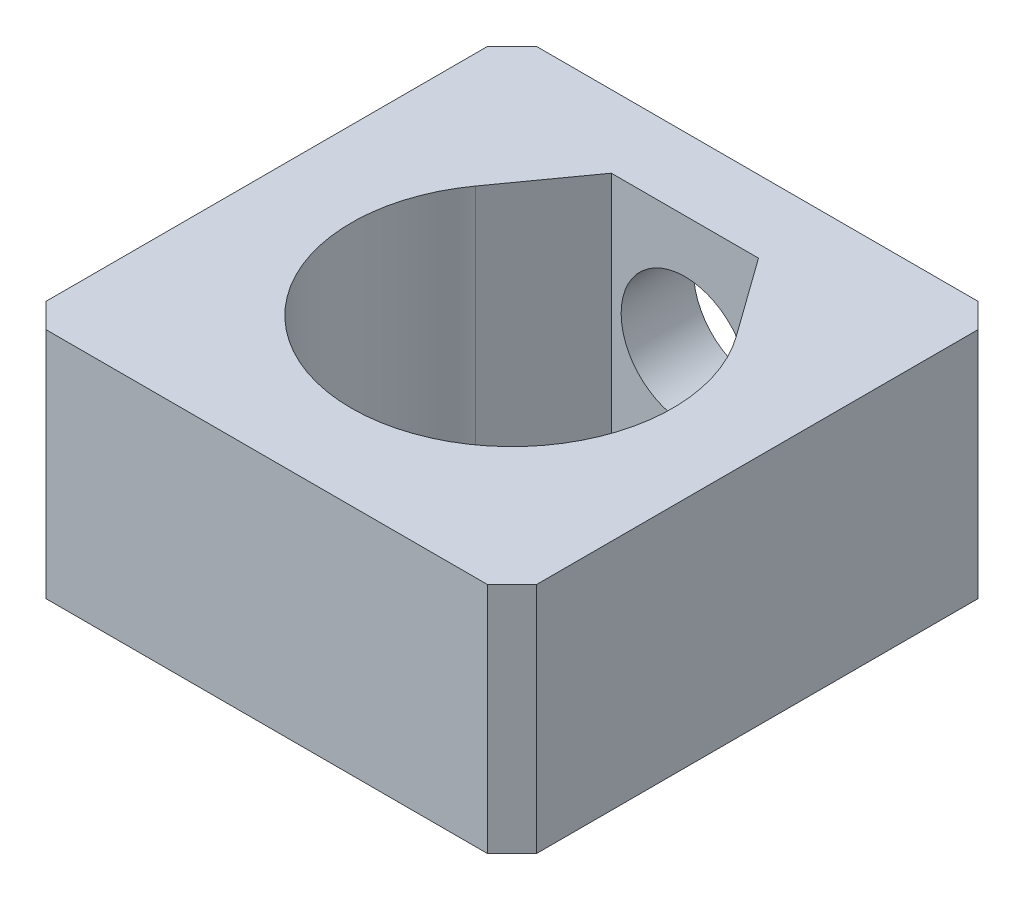
ISO-10303-21;
HEADER;
FILE_DESCRIPTION(('STEP AP214'),'2;1');
FILE_NAME('part.step','',(''),(''),'','','');
FILE_SCHEMA(('AUTOMOTIVE_DESIGN { 1 0 10303 214 1 1 1 1 }'));
ENDSEC;
DATA;
#1=APPLICATION_CONTEXT('core data for automotive mechanical design processes');
#2=APPLICATION_PROTOCOL_DEFINITION('international standard','automotive_design',2000,#1);
#3=PRODUCT_CONTEXT('',#1,'mechanical');
#4=PRODUCT('Part','Part','',(#3));
#5=PRODUCT_RELATED_PRODUCT_CATEGORY('part','',(#4));
#6=PRODUCT_DEFINITION_FORMATION('','',#4);
#7=PRODUCT_DEFINITION_CONTEXT('part definition',#1,'design');
#8=PRODUCT_DEFINITION('design','',#6,#7);
#9=PRODUCT_DEFINITION_SHAPE('','',#8);
#10=(LENGTH_UNIT() NAMED_UNIT(*) SI_UNIT(.MILLI.,.METRE.));
#11=(NAMED_UNIT(*) PLANE_ANGLE_UNIT() SI_UNIT($,.RADIAN.));
#12=(NAMED_UNIT(*) SI_UNIT($,.STERADIAN.) SOLID_ANGLE_UNIT());
#13=UNCERTAINTY_MEASURE_WITH_UNIT(LENGTH_MEASURE(1.E-05),#10,'distance_accuracy_value','');
#14=(GEOMETRIC_REPRESENTATION_CONTEXT(3) GLOBAL_UNCERTAINTY_ASSIGNED_CONTEXT((#13)) GLOBAL_UNIT_ASSIGNED_CONTEXT((#10,
#11,#12)) REPRESENTATION_CONTEXT('',''));
#15=CARTESIAN_POINT('',(0.,0.,0.));
#16=DIRECTION('',(0.,0.,1.));
#17=DIRECTION('',(1.,0.,0.));
#18=AXIS2_PLACEMENT_3D('',#15,#16,#17);
#19=CARTESIAN_POINT('',(0.,9.5,0.));
#20=DIRECTION('',(0.,1.,0.));
#21=DIRECTION('',(0.,0.,1.));
#22=AXIS2_PLACEMENT_3D('',#19,#20,#21);
#23=PLANE('',#22);
#24=DIRECTION('',(0.,0.,1.));
#25=VECTOR('',#24,1.);
#26=CARTESIAN_POINT('',(-10.,9.5,-10.));
#27=LINE('',#26,#25);
#28=CARTESIAN_POINT('',(-10.,9.5,-9.));
#29=VERTEX_POINT('',#28);
#30=CARTESIAN_POINT('',(-10.,9.5,9.));
#31=VERTEX_POINT('',#30);
#32=EDGE_CURVE('E192',#29,#31,#27,.T.);
#33=ORIENTED_EDGE('',*,*,#32,.T.);
#34=DIRECTION('',(-0.707106781186546,0.,-0.707106781186549));
#35=VECTOR('',#34,1.);
#36=CARTESIAN_POINT('',(-9.50000000000002,9.5,9.49999999999998));
#37=LINE('',#36,#35);
#38=CARTESIAN_POINT('',(-9.,9.5,10.));
#39=VERTEX_POINT('',#38);
#40=EDGE_CURVE('E254',#31,#39,#37,.F.);
#41=ORIENTED_EDGE('',*,*,#40,.T.);
#42=DIRECTION('',(1.,0.,0.));
#43=VECTOR('',#42,1.);
#44=CARTESIAN_POINT('',(-10.,9.5,10.));
#45=LINE('',#44,#43);
#46=CARTESIAN_POINT('',(9.,9.5,10.));
#47=VERTEX_POINT('',#46);
#48=EDGE_CURVE('E196',#39,#47,#45,.T.);
#49=ORIENTED_EDGE('',*,*,#48,.T.);
#50=DIRECTION('',(-0.707106781186549,0.,0.707106781186546));
#51=VECTOR('',#50,1.);
#52=CARTESIAN_POINT('',(9.49999999999998,9.5,9.50000000000002));
#53=LINE('',#52,#51);
#54=CARTESIAN_POINT('',(10.,9.5,9.));
#55=VERTEX_POINT('',#54);
#56=EDGE_CURVE('E246',#47,#55,#53,.F.);
#57=ORIENTED_EDGE('',*,*,#56,.T.);
#58=DIRECTION('',(0.,0.,-1.));
#59=VECTOR('',#58,1.);
#60=CARTESIAN_POINT('',(10.,9.5,-10.));
#61=LINE('',#60,#59);
#62=CARTESIAN_POINT('',(10.,9.5,-9.));
#63=VERTEX_POINT('',#62);
#64=EDGE_CURVE('E201',#55,#63,#61,.T.);
#65=ORIENTED_EDGE('',*,*,#64,.T.);
#66=DIRECTION('',(0.707106781186546,0.,0.707106781186549));
#67=VECTOR('',#66,1.);
#68=CARTESIAN_POINT('',(9.50000000000002,9.5,-9.49999999999998));
#69=LINE('',#68,#67);
#70=CARTESIAN_POINT('',(9.,9.5,-10.));
#71=VERTEX_POINT('',#70);
#72=EDGE_CURVE('E68',#63,#71,#69,.F.);
#73=ORIENTED_EDGE('',*,*,#72,.T.);
#74=DIRECTION('',(-1.,0.,0.));
#75=VECTOR('',#74,1.);
#76=CARTESIAN_POINT('',(-10.,9.5,-10.));
#77=LINE('',#76,#75);
#78=CARTESIAN_POINT('',(-9.,9.5,-10.));
#79=VERTEX_POINT('',#78);
#80=EDGE_CURVE('E204',#71,#79,#77,.T.);
#81=ORIENTED_EDGE('',*,*,#80,.T.);
#82=DIRECTION('',(0.707106781186549,0.,-0.707106781186546));
#83=VECTOR('',#82,1.);
#84=CARTESIAN_POINT('',(-9.49999999999998,9.5,-9.50000000000002));
#85=LINE('',#84,#83);
#86=EDGE_CURVE('E251',#79,#29,#85,.F.);
#87=ORIENTED_EDGE('',*,*,#86,.T.);
#88=EDGE_LOOP('',(#33,#41,#49,#57,#65,#73,#81,#87));
#89=FACE_BOUND('',#88,.T.);
#90=DIRECTION('',(-0.583497054663582,0.,-0.812115254873916));
#91=VECTOR('',#90,1.);
#92=CARTESIAN_POINT('',(3.,9.5,-7.05));
#93=LINE('',#92,#91);
#94=CARTESIAN_POINT('',(5.31935491942415,9.5,-3.82190570804646));
#95=VERTEX_POINT('',#94);
#96=CARTESIAN_POINT('',(3.,9.5,-7.05));
#97=VERTEX_POINT('',#96);
#98=EDGE_CURVE('E148',#95,#97,#93,.T.);
#99=ORIENTED_EDGE('',*,*,#98,.F.);
#100=CARTESIAN_POINT('',(0.,9.5,0.));
#101=DIRECTION('',(0.,1.,0.));
#102=DIRECTION('',(0.,0.,1.));
#103=AXIS2_PLACEMENT_3D('',#100,#101,#102);
#104=CIRCLE('',#103,6.55);
#105=CARTESIAN_POINT('',(-5.31935491942415,9.5,-3.82190570804646));
#106=VERTEX_POINT('',#105);
#107=EDGE_CURVE('E137',#106,#95,#104,.T.);
#108=ORIENTED_EDGE('',*,*,#107,.F.);
#109=DIRECTION('',(-0.583497054663582,0.,0.812115254873916));
#110=VECTOR('',#109,1.);
#111=CARTESIAN_POINT('',(-5.31935491942415,9.5,-3.82190570804646));
#112=LINE('',#111,#110);
#113=CARTESIAN_POINT('',(-3.,9.5,-7.05));
#114=VERTEX_POINT('',#113);
#115=EDGE_CURVE('E166',#114,#106,#112,.T.);
#116=ORIENTED_EDGE('',*,*,#115,.F.);
#117=DIRECTION('',(-1.,0.,0.));
#118=VECTOR('',#117,1.);
#119=CARTESIAN_POINT('',(-3.,9.5,-7.05));
#120=LINE('',#119,#118);
#121=EDGE_CURVE('E162',#97,#114,#120,.T.);
#122=ORIENTED_EDGE('',*,*,#121,.F.);
#123=EDGE_LOOP('',(#99,#108,#116,#122));
#124=FACE_BOUND('',#123,.T.);
#125=ADVANCED_FACE('F44',(#89,#124),#23,.T.);
#126=CARTESIAN_POINT('',(0.,0.,0.));
#127=DIRECTION('',(0.,1.,0.));
#128=DIRECTION('',(0.,0.,1.));
#129=AXIS2_PLACEMENT_3D('',#126,#127,#128);
#130=PLANE('',#129);
#131=DIRECTION('',(1.,0.,0.));
#132=VECTOR('',#131,1.);
#133=CARTESIAN_POINT('',(-10.,0.,10.));
#134=LINE('',#133,#132);
#135=CARTESIAN_POINT('',(-9.,0.,10.));
#136=VERTEX_POINT('',#135);
#137=CARTESIAN_POINT('',(9.,0.,10.));
#138=VERTEX_POINT('',#137);
#139=EDGE_CURVE('E211',#136,#138,#134,.T.);
#140=ORIENTED_EDGE('',*,*,#139,.F.);
#141=DIRECTION('',(0.707106781186546,0.,0.707106781186549));
#142=VECTOR('',#141,1.);
#143=CARTESIAN_POINT('',(-9.,0.,10.));
#144=LINE('',#143,#142);
#145=CARTESIAN_POINT('',(-10.,0.,9.));
#146=VERTEX_POINT('',#145);
#147=EDGE_CURVE('E236',#136,#146,#144,.F.);
#148=ORIENTED_EDGE('',*,*,#147,.T.);
#149=DIRECTION('',(0.,0.,1.));
#150=VECTOR('',#149,1.);
#151=CARTESIAN_POINT('',(-10.,0.,-10.));
#152=LINE('',#151,#150);
#153=CARTESIAN_POINT('',(-10.,0.,-9.));
#154=VERTEX_POINT('',#153);
#155=EDGE_CURVE('E157',#154,#146,#152,.T.);
#156=ORIENTED_EDGE('',*,*,#155,.F.);
#157=DIRECTION('',(-0.707106781186549,0.,0.707106781186546));
#158=VECTOR('',#157,1.);
#159=CARTESIAN_POINT('',(-10.,0.,-9.));
#160=LINE('',#159,#158);
#161=CARTESIAN_POINT('',(-9.,0.,-10.));
#162=VERTEX_POINT('',#161);
#163=EDGE_CURVE('E233',#154,#162,#160,.F.);
#164=ORIENTED_EDGE('',*,*,#163,.T.);
#165=DIRECTION('',(-1.,0.,0.));
#166=VECTOR('',#165,1.);
#167=CARTESIAN_POINT('',(-10.,0.,-10.));
#168=LINE('',#167,#166);
#169=CARTESIAN_POINT('',(9.,0.,-10.));
#170=VERTEX_POINT('',#169);
#171=EDGE_CURVE('E197',#170,#162,#168,.T.);
#172=ORIENTED_EDGE('',*,*,#171,.F.);
#173=DIRECTION('',(-0.707106781186546,0.,-0.707106781186549));
#174=VECTOR('',#173,1.);
#175=CARTESIAN_POINT('',(9.,0.,-10.));
#176=LINE('',#175,#174);
#177=CARTESIAN_POINT('',(10.,0.,-9.));
#178=VERTEX_POINT('',#177);
#179=EDGE_CURVE('E230',#170,#178,#176,.F.);
#180=ORIENTED_EDGE('',*,*,#179,.T.);
#181=DIRECTION('',(0.,0.,-1.));
#182=VECTOR('',#181,1.);
#183=CARTESIAN_POINT('',(10.,0.,-10.));
#184=LINE('',#183,#182);
#185=CARTESIAN_POINT('',(10.,0.,9.));
#186=VERTEX_POINT('',#185);
#187=EDGE_CURVE('E215',#186,#178,#184,.T.);
#188=ORIENTED_EDGE('',*,*,#187,.F.);
#189=DIRECTION('',(0.707106781186549,0.,-0.707106781186546));
#190=VECTOR('',#189,1.);
#191=CARTESIAN_POINT('',(10.,0.,9.));
#192=LINE('',#191,#190);
#193=EDGE_CURVE('E227',#186,#138,#192,.F.);
#194=ORIENTED_EDGE('',*,*,#193,.T.);
#195=EDGE_LOOP('',(#140,#148,#156,#164,#172,#180,#188,#194));
#196=FACE_BOUND('',#195,.T.);
#197=CARTESIAN_POINT('',(0.,0.,0.));
#198=DIRECTION('',(0.,1.,0.));
#199=DIRECTION('',(0.,0.,1.));
#200=AXIS2_PLACEMENT_3D('',#197,#198,#199);
#201=CIRCLE('',#200,6.55);
#202=CARTESIAN_POINT('',(-5.31935491942415,0.,-3.82190570804646));
#203=VERTEX_POINT('',#202);
#204=CARTESIAN_POINT('',(5.31935491942415,0.,-3.82190570804646));
#205=VERTEX_POINT('',#204);
#206=EDGE_CURVE('E172',#203,#205,#201,.T.);
#207=ORIENTED_EDGE('',*,*,#206,.T.);
#208=DIRECTION('',(-0.583497054663582,0.,-0.812115254873916));
#209=VECTOR('',#208,1.);
#210=CARTESIAN_POINT('',(3.,0.,-7.05));
#211=LINE('',#210,#209);
#212=CARTESIAN_POINT('',(3.,0.,-7.05));
#213=VERTEX_POINT('',#212);
#214=EDGE_CURVE('E155',#205,#213,#211,.T.);
#215=ORIENTED_EDGE('',*,*,#214,.T.);
#216=DIRECTION('',(-1.,0.,0.));
#217=VECTOR('',#216,1.);
#218=CARTESIAN_POINT('',(-3.,0.,-7.05));
#219=LINE('',#218,#217);
#220=CARTESIAN_POINT('',(-3.,0.,-7.05));
#221=VERTEX_POINT('',#220);
#222=EDGE_CURVE('E178',#213,#221,#219,.T.);
#223=ORIENTED_EDGE('',*,*,#222,.T.);
#224=DIRECTION('',(-0.583497054663582,0.,0.812115254873916));
#225=VECTOR('',#224,1.);
#226=CARTESIAN_POINT('',(-5.31935491942415,0.,-3.82190570804646));
#227=LINE('',#226,#225);
#228=EDGE_CURVE('E149',#221,#203,#227,.T.);
#229=ORIENTED_EDGE('',*,*,#228,.T.);
#230=EDGE_LOOP('',(#207,#215,#223,#229));
#231=FACE_BOUND('',#230,.T.);
#232=ADVANCED_FACE('F274',(#196,#231),#130,.F.);
#233=CARTESIAN_POINT('',(-10.,9.5,-10.));
#234=DIRECTION('',(1.,0.,0.));
#235=DIRECTION('',(0.,0.,-1.));
#236=AXIS2_PLACEMENT_3D('',#233,#234,#235);
#237=PLANE('',#236);
#238=ORIENTED_EDGE('',*,*,#155,.T.);
#239=DIRECTION('',(0.,1.,0.));
#240=VECTOR('',#239,1.);
#241=CARTESIAN_POINT('',(-10.,9.5,9.));
#242=LINE('',#241,#240);
#243=EDGE_CURVE('E243',#146,#31,#242,.T.);
#244=ORIENTED_EDGE('',*,*,#243,.T.);
#245=ORIENTED_EDGE('',*,*,#32,.F.);
#246=DIRECTION('',(0.,-1.,0.));
#247=VECTOR('',#246,1.);
#248=CARTESIAN_POINT('',(-10.,9.5,-9.));
#249=LINE('',#248,#247);
#250=EDGE_CURVE('E239',#29,#154,#249,.T.);
#251=ORIENTED_EDGE('',*,*,#250,.T.);
#252=EDGE_LOOP('',(#238,#244,#245,#251));
#253=FACE_BOUND('',#252,.T.);
#254=ADVANCED_FACE('F288',(#253),#237,.F.);
#255=CARTESIAN_POINT('',(-10.,9.5,10.));
#256=DIRECTION('',(0.,0.,-1.));
#257=DIRECTION('',(-1.,0.,0.));
#258=AXIS2_PLACEMENT_3D('',#255,#256,#257);
#259=PLANE('',#258);
#260=ORIENTED_EDGE('',*,*,#48,.F.);
#261=DIRECTION('',(0.,-1.,0.));
#262=VECTOR('',#261,1.);
#263=CARTESIAN_POINT('',(-9.,9.5,10.));
#264=LINE('',#263,#262);
#265=EDGE_CURVE('E223',#39,#136,#264,.T.);
#266=ORIENTED_EDGE('',*,*,#265,.T.);
#267=ORIENTED_EDGE('',*,*,#139,.T.);
#268=DIRECTION('',(0.,1.,0.));
#269=VECTOR('',#268,1.);
#270=CARTESIAN_POINT('',(9.,9.5,10.));
#271=LINE('',#270,#269);
#272=EDGE_CURVE('E207',#138,#47,#271,.T.);
#273=ORIENTED_EDGE('',*,*,#272,.T.);
#274=EDGE_LOOP('',(#260,#266,#267,#273));
#275=FACE_BOUND('',#274,.T.);
#276=ADVANCED_FACE('F296',(#275),#259,.F.);
#277=CARTESIAN_POINT('',(10.,9.5,-10.));
#278=DIRECTION('',(-1.,0.,0.));
#279=DIRECTION('',(0.,0.,1.));
#280=AXIS2_PLACEMENT_3D('',#277,#278,#279);
#281=PLANE('',#280);
#282=ORIENTED_EDGE('',*,*,#187,.T.);
#283=DIRECTION('',(0.,1.,0.));
#284=VECTOR('',#283,1.);
#285=CARTESIAN_POINT('',(10.,9.5,-9.));
#286=LINE('',#285,#284);
#287=EDGE_CURVE('E11',#178,#63,#286,.T.);
#288=ORIENTED_EDGE('',*,*,#287,.T.);
#289=ORIENTED_EDGE('',*,*,#64,.F.);
#290=DIRECTION('',(0.,-1.,0.));
#291=VECTOR('',#290,1.);
#292=CARTESIAN_POINT('',(10.,9.5,9.));
#293=LINE('',#292,#291);
#294=EDGE_CURVE('E54',#55,#186,#293,.T.);
#295=ORIENTED_EDGE('',*,*,#294,.T.);
#296=EDGE_LOOP('',(#282,#288,#289,#295));
#297=FACE_BOUND('',#296,.T.);
#298=ADVANCED_FACE('F268',(#297),#281,.F.);
#299=CARTESIAN_POINT('',(-10.,9.5,-10.));
#300=DIRECTION('',(0.,0.,1.));
#301=DIRECTION('',(1.,0.,0.));
#302=AXIS2_PLACEMENT_3D('',#299,#300,#301);
#303=PLANE('',#302);
#304=CARTESIAN_POINT('',(0.,4.75,-10.));
#305=DIRECTION('',(0.,0.,-1.));
#306=DIRECTION('',(-1.,0.,0.));
#307=AXIS2_PLACEMENT_3D('',#304,#305,#306);
#308=CIRCLE('',#307,2.6);
#309=CARTESIAN_POINT('',(-2.6,4.75,-10.));
#310=VERTEX_POINT('',#309);
#311=EDGE_CURVE('E175',#310,#310,#308,.T.);
#312=ORIENTED_EDGE('',*,*,#311,.F.);
#313=EDGE_LOOP('',(#312));
#314=FACE_BOUND('',#313,.T.);
#315=ORIENTED_EDGE('',*,*,#171,.T.);
#316=DIRECTION('',(0.,1.,0.));
#317=VECTOR('',#316,1.);
#318=CARTESIAN_POINT('',(-9.,9.5,-10.));
#319=LINE('',#318,#317);
#320=EDGE_CURVE('E61',#162,#79,#319,.T.);
#321=ORIENTED_EDGE('',*,*,#320,.T.);
#322=ORIENTED_EDGE('',*,*,#80,.F.);
#323=DIRECTION('',(0.,-1.,0.));
#324=VECTOR('',#323,1.);
#325=CARTESIAN_POINT('',(9.,9.5,-10.));
#326=LINE('',#325,#324);
#327=EDGE_CURVE('E257',#71,#170,#326,.T.);
#328=ORIENTED_EDGE('',*,*,#327,.T.);
#329=EDGE_LOOP('',(#315,#321,#322,#328));
#330=FACE_BOUND('',#329,.T.);
#331=ADVANCED_FACE('F280',(#314,#330),#303,.F.);
#332=CARTESIAN_POINT('',(0.,9.5,0.));
#333=DIRECTION('',(0.,-1.,0.));
#334=DIRECTION('',(0.,0.,-1.));
#335=AXIS2_PLACEMENT_3D('',#332,#333,#334);
#336=CYLINDRICAL_SURFACE('',#335,6.55);
#337=ORIENTED_EDGE('',*,*,#206,.F.);
#338=DIRECTION('',(0.,-1.,0.));
#339=VECTOR('',#338,1.);
#340=CARTESIAN_POINT('',(-5.31935491942415,9.5,-3.82190570804646));
#341=LINE('',#340,#339);
#342=EDGE_CURVE('E143',#106,#203,#341,.T.);
#343=ORIENTED_EDGE('',*,*,#342,.F.);
#344=ORIENTED_EDGE('',*,*,#107,.T.);
#345=DIRECTION('',(0.,-1.,0.));
#346=VECTOR('',#345,1.);
#347=CARTESIAN_POINT('',(5.31935491942415,9.5,-3.82190570804646));
#348=LINE('',#347,#346);
#349=EDGE_CURVE('E140',#95,#205,#348,.T.);
#350=ORIENTED_EDGE('',*,*,#349,.T.);
#351=EDGE_LOOP('',(#337,#343,#344,#350));
#352=FACE_BOUND('',#351,.T.);
#353=ADVANCED_FACE('F139',(#352),#336,.F.);
#354=CARTESIAN_POINT('',(3.,9.5,-7.05));
#355=DIRECTION('',(-0.812115254873916,0.,0.583497054663582));
#356=DIRECTION('',(0.583497054663582,0.,0.812115254873916));
#357=AXIS2_PLACEMENT_3D('',#354,#355,#356);
#358=PLANE('',#357);
#359=ORIENTED_EDGE('',*,*,#214,.F.);
#360=ORIENTED_EDGE('',*,*,#349,.F.);
#361=ORIENTED_EDGE('',*,*,#98,.T.);
#362=DIRECTION('',(0.,-1.,0.));
#363=VECTOR('',#362,1.);
#364=CARTESIAN_POINT('',(3.,9.5,-7.05));
#365=LINE('',#364,#363);
#366=EDGE_CURVE('E158',#97,#213,#365,.T.);
#367=ORIENTED_EDGE('',*,*,#366,.T.);
#368=EDGE_LOOP('',(#359,#360,#361,#367));
#369=FACE_BOUND('',#368,.T.);
#370=ADVANCED_FACE('F152',(#369),#358,.T.);
#371=CARTESIAN_POINT('',(-3.,9.5,-7.05));
#372=DIRECTION('',(0.,0.,1.));
#373=DIRECTION('',(1.,0.,0.));
#374=AXIS2_PLACEMENT_3D('',#371,#372,#373);
#375=PLANE('',#374);
#376=CARTESIAN_POINT('',(0.,4.75,-7.05));
#377=DIRECTION('',(0.,0.,1.));
#378=DIRECTION('',(1.,0.,0.));
#379=AXIS2_PLACEMENT_3D('',#376,#377,#378);
#380=CIRCLE('',#379,2.6);
#381=CARTESIAN_POINT('',(2.6,4.75,-7.05));
#382=VERTEX_POINT('',#381);
#383=EDGE_CURVE('E467',#382,#382,#380,.F.);
#384=ORIENTED_EDGE('',*,*,#383,.T.);
#385=EDGE_LOOP('',(#384));
#386=FACE_BOUND('',#385,.T.);
#387=ORIENTED_EDGE('',*,*,#222,.F.);
#388=ORIENTED_EDGE('',*,*,#366,.F.);
#389=ORIENTED_EDGE('',*,*,#121,.T.);
#390=DIRECTION('',(0.,-1.,0.));
#391=VECTOR('',#390,1.);
#392=CARTESIAN_POINT('',(-3.,9.5,-7.05));
#393=LINE('',#392,#391);
#394=EDGE_CURVE('E187',#114,#221,#393,.T.);
#395=ORIENTED_EDGE('',*,*,#394,.T.);
#396=EDGE_LOOP('',(#387,#388,#389,#395));
#397=FACE_BOUND('',#396,.T.);
#398=ADVANCED_FACE('F379',(#386,#397),#375,.T.);
#399=CARTESIAN_POINT('',(-5.31935491942415,9.5,-3.82190570804646));
#400=DIRECTION('',(0.812115254873916,0.,0.583497054663582));
#401=DIRECTION('',(0.583497054663582,0.,-0.812115254873916));
#402=AXIS2_PLACEMENT_3D('',#399,#400,#401);
#403=PLANE('',#402);
#404=ORIENTED_EDGE('',*,*,#228,.F.);
#405=ORIENTED_EDGE('',*,*,#394,.F.);
#406=ORIENTED_EDGE('',*,*,#115,.T.);
#407=ORIENTED_EDGE('',*,*,#342,.T.);
#408=EDGE_LOOP('',(#404,#405,#406,#407));
#409=FACE_BOUND('',#408,.T.);
#410=ADVANCED_FACE('F369',(#409),#403,.T.);
#411=CARTESIAN_POINT('',(0.,4.75,10.001));
#412=DIRECTION('',(0.,0.,-1.));
#413=DIRECTION('',(-1.,0.,0.));
#414=AXIS2_PLACEMENT_3D('',#411,#412,#413);
#415=CYLINDRICAL_SURFACE('',#414,2.6);
#416=ORIENTED_EDGE('',*,*,#383,.F.);
#417=EDGE_LOOP('',(#416));
#418=FACE_BOUND('',#417,.T.);
#419=ORIENTED_EDGE('',*,*,#311,.T.);
#420=EDGE_LOOP('',(#419));
#421=FACE_BOUND('',#420,.T.);
#422=ADVANCED_FACE('F326',(#418,#421),#415,.F.);
#423=CARTESIAN_POINT('',(-9.,9.5,10.));
#424=DIRECTION('',(0.707106781186549,0.,-0.707106781186546));
#425=DIRECTION('',(0.,-1.,0.));
#426=AXIS2_PLACEMENT_3D('',#423,#424,#425);
#427=PLANE('',#426);
#428=ORIENTED_EDGE('',*,*,#40,.F.);
#429=ORIENTED_EDGE('',*,*,#243,.F.);
#430=ORIENTED_EDGE('',*,*,#147,.F.);
#431=ORIENTED_EDGE('',*,*,#265,.F.);
#432=EDGE_LOOP('',(#428,#429,#430,#431));
#433=FACE_BOUND('',#432,.T.);
#434=ADVANCED_FACE('F293',(#433),#427,.F.);
#435=CARTESIAN_POINT('',(-10.,9.5,-9.));
#436=DIRECTION('',(0.707106781186546,0.,0.707106781186549));
#437=DIRECTION('',(0.,-1.,0.));
#438=AXIS2_PLACEMENT_3D('',#435,#436,#437);
#439=PLANE('',#438);
#440=ORIENTED_EDGE('',*,*,#86,.F.);
#441=ORIENTED_EDGE('',*,*,#320,.F.);
#442=ORIENTED_EDGE('',*,*,#163,.F.);
#443=ORIENTED_EDGE('',*,*,#250,.F.);
#444=EDGE_LOOP('',(#440,#441,#442,#443));
#445=FACE_BOUND('',#444,.T.);
#446=ADVANCED_FACE('F285',(#445),#439,.F.);
#447=CARTESIAN_POINT('',(9.,9.5,-10.));
#448=DIRECTION('',(-0.707106781186549,0.,0.707106781186546));
#449=DIRECTION('',(0.,-1.,0.));
#450=AXIS2_PLACEMENT_3D('',#447,#448,#449);
#451=PLANE('',#450);
#452=ORIENTED_EDGE('',*,*,#72,.F.);
#453=ORIENTED_EDGE('',*,*,#287,.F.);
#454=ORIENTED_EDGE('',*,*,#179,.F.);
#455=ORIENTED_EDGE('',*,*,#327,.F.);
#456=EDGE_LOOP('',(#452,#453,#454,#455));
#457=FACE_BOUND('',#456,.T.);
#458=ADVANCED_FACE('F279',(#457),#451,.F.);
#459=CARTESIAN_POINT('',(10.,9.5,9.));
#460=DIRECTION('',(-0.707106781186546,0.,-0.707106781186549));
#461=DIRECTION('',(0.,-1.,0.));
#462=AXIS2_PLACEMENT_3D('',#459,#460,#461);
#463=PLANE('',#462);
#464=ORIENTED_EDGE('',*,*,#56,.F.);
#465=ORIENTED_EDGE('',*,*,#272,.F.);
#466=ORIENTED_EDGE('',*,*,#193,.F.);
#467=ORIENTED_EDGE('',*,*,#294,.F.);
#468=EDGE_LOOP('',(#464,#465,#466,#467));
#469=FACE_BOUND('',#468,.T.);
#470=ADVANCED_FACE('F47',(#469),#463,.F.);
#471=CLOSED_SHELL('',(#125,#232,#254,#276,#298,#331,#353,#370,#398,#410,#422,#434,#446,#458,#470));
#472=MANIFOLD_SOLID_BREP('B2',#471);
#473=ADVANCED_BREP_SHAPE_REPRESENTATION('',(#18,#472),#14);
#474=SHAPE_DEFINITION_REPRESENTATION(#9,#473);
ENDSEC;
END-ISO-10303-21;
